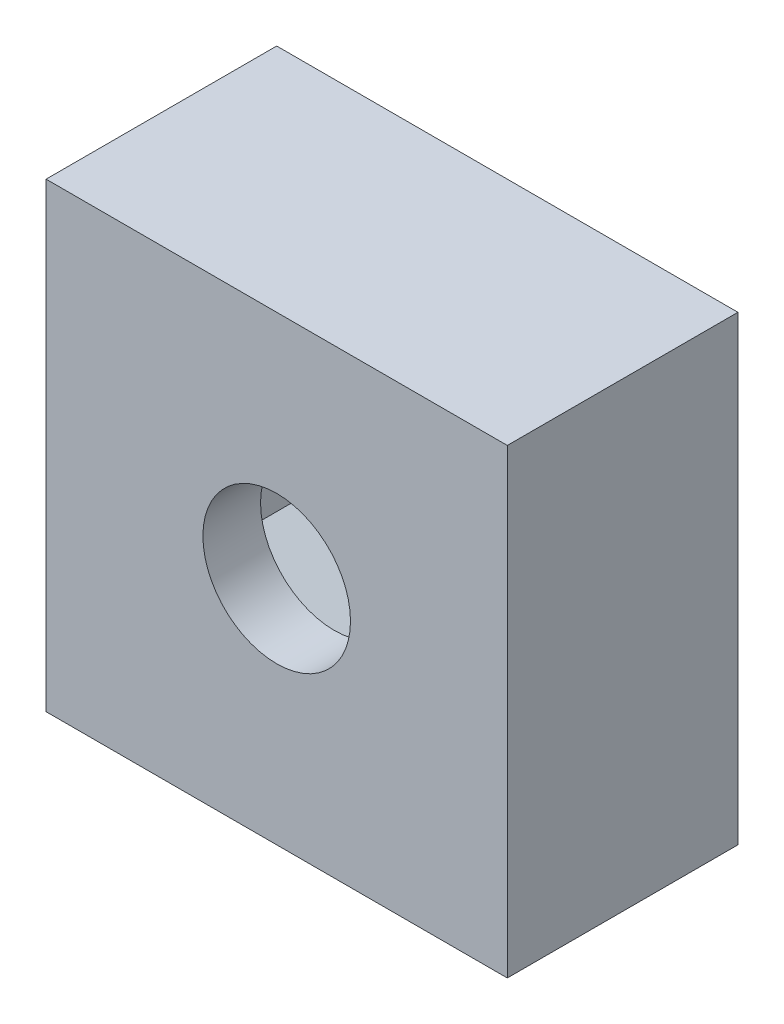
ISO-10303-21;
HEADER;
FILE_DESCRIPTION(('STEP AP214'),'2;1');
FILE_NAME('part.step','',(''),(''),'','','');
FILE_SCHEMA(('AUTOMOTIVE_DESIGN { 1 0 10303 214 1 1 1 1 }'));
ENDSEC;
DATA;
#1=APPLICATION_CONTEXT('core data for automotive mechanical design processes');
#2=APPLICATION_PROTOCOL_DEFINITION('international standard','automotive_design',2000,#1);
#3=PRODUCT_CONTEXT('',#1,'mechanical');
#4=PRODUCT('Part','Part','',(#3));
#5=PRODUCT_RELATED_PRODUCT_CATEGORY('part','',(#4));
#6=PRODUCT_DEFINITION_FORMATION('','',#4);
#7=PRODUCT_DEFINITION_CONTEXT('part definition',#1,'design');
#8=PRODUCT_DEFINITION('design','',#6,#7);
#9=PRODUCT_DEFINITION_SHAPE('','',#8);
#10=(LENGTH_UNIT() NAMED_UNIT(*) SI_UNIT(.MILLI.,.METRE.));
#11=(NAMED_UNIT(*) PLANE_ANGLE_UNIT() SI_UNIT($,.RADIAN.));
#12=(NAMED_UNIT(*) SI_UNIT($,.STERADIAN.) SOLID_ANGLE_UNIT());
#13=UNCERTAINTY_MEASURE_WITH_UNIT(LENGTH_MEASURE(1.E-05),#10,'distance_accuracy_value','');
#14=(GEOMETRIC_REPRESENTATION_CONTEXT(3) GLOBAL_UNCERTAINTY_ASSIGNED_CONTEXT((#13)) GLOBAL_UNIT_ASSIGNED_CONTEXT((#10,
#11,#12)) REPRESENTATION_CONTEXT('',''));
#15=CARTESIAN_POINT('',(0.,0.,0.));
#16=DIRECTION('',(0.,0.,1.));
#17=DIRECTION('',(1.,0.,0.));
#18=AXIS2_PLACEMENT_3D('',#15,#16,#17);
#19=CARTESIAN_POINT('',(2.975,0.,3.75));
#20=DIRECTION('',(-1.,0.,0.));
#21=DIRECTION('',(0.,-1.,0.));
#22=AXIS2_PLACEMENT_3D('',#19,#20,#21);
#23=PLANE('',#22);
#24=DIRECTION('',(0.,1.,0.));
#25=VECTOR('',#24,1.);
#26=CARTESIAN_POINT('',(2.975,0.,1.25));
#27=LINE('',#26,#25);
#28=CARTESIAN_POINT('',(2.975,-1.71761705083914,1.25));
#29=VERTEX_POINT('',#28);
#30=CARTESIAN_POINT('',(2.975,1.71761705083914,1.25));
#31=VERTEX_POINT('',#30);
#32=EDGE_CURVE('E211',#29,#31,#27,.T.);
#33=ORIENTED_EDGE('',*,*,#32,.F.);
#34=DIRECTION('',(0.,0.,-1.));
#35=VECTOR('',#34,1.);
#36=CARTESIAN_POINT('',(2.975,-1.71761705083914,3.75));
#37=LINE('',#36,#35);
#38=CARTESIAN_POINT('',(2.975,-1.71761705083914,3.75));
#39=VERTEX_POINT('',#38);
#40=EDGE_CURVE('E136',#39,#29,#37,.T.);
#41=ORIENTED_EDGE('',*,*,#40,.F.);
#42=DIRECTION('',(0.,1.,0.));
#43=VECTOR('',#42,1.);
#44=CARTESIAN_POINT('',(2.975,0.,3.75));
#45=LINE('',#44,#43);
#46=CARTESIAN_POINT('',(2.975,1.71761705083914,3.75));
#47=VERTEX_POINT('',#46);
#48=EDGE_CURVE('E121',#39,#47,#45,.T.);
#49=ORIENTED_EDGE('',*,*,#48,.T.);
#50=DIRECTION('',(0.,0.,-1.));
#51=VECTOR('',#50,1.);
#52=CARTESIAN_POINT('',(2.975,1.71761705083914,3.75));
#53=LINE('',#52,#51);
#54=EDGE_CURVE('E133',#47,#31,#53,.T.);
#55=ORIENTED_EDGE('',*,*,#54,.T.);
#56=EDGE_LOOP('',(#33,#41,#49,#55));
#57=FACE_BOUND('',#56,.T.);
#58=ADVANCED_FACE('F33',(#57),#23,.T.);
#59=CARTESIAN_POINT('',(1.4875,2.5764255762587,3.75));
#60=DIRECTION('',(-0.5,-0.866025403784439,0.));
#61=DIRECTION('',(0.866025403784439,-0.5,0.));
#62=AXIS2_PLACEMENT_3D('',#59,#60,#61);
#63=PLANE('',#62);
#64=DIRECTION('',(-0.866025403784439,0.5,0.));
#65=VECTOR('',#64,1.);
#66=CARTESIAN_POINT('',(1.4875,2.5764255762587,1.25));
#67=LINE('',#66,#65);
#68=CARTESIAN_POINT('',(0.,3.43523410167827,1.25));
#69=VERTEX_POINT('',#68);
#70=EDGE_CURVE('E140',#31,#69,#67,.T.);
#71=ORIENTED_EDGE('',*,*,#70,.F.);
#72=ORIENTED_EDGE('',*,*,#54,.F.);
#73=DIRECTION('',(-0.866025403784439,0.5,0.));
#74=VECTOR('',#73,1.);
#75=CARTESIAN_POINT('',(1.4875,2.5764255762587,3.75));
#76=LINE('',#75,#74);
#77=CARTESIAN_POINT('',(0.,3.43523410167827,3.75));
#78=VERTEX_POINT('',#77);
#79=EDGE_CURVE('E117',#47,#78,#76,.T.);
#80=ORIENTED_EDGE('',*,*,#79,.T.);
#81=DIRECTION('',(0.,0.,-1.));
#82=VECTOR('',#81,1.);
#83=CARTESIAN_POINT('',(0.,3.43523410167827,3.75));
#84=LINE('',#83,#82);
#85=EDGE_CURVE('E142',#78,#69,#84,.T.);
#86=ORIENTED_EDGE('',*,*,#85,.T.);
#87=EDGE_LOOP('',(#71,#72,#80,#86));
#88=FACE_BOUND('',#87,.T.);
#89=ADVANCED_FACE('F139',(#88),#63,.T.);
#90=CARTESIAN_POINT('',(-1.4875,2.5764255762587,3.75));
#91=DIRECTION('',(0.5,-0.866025403784439,0.));
#92=DIRECTION('',(0.866025403784439,0.5,0.));
#93=AXIS2_PLACEMENT_3D('',#90,#91,#92);
#94=PLANE('',#93);
#95=DIRECTION('',(-0.866025403784439,-0.5,0.));
#96=VECTOR('',#95,1.);
#97=CARTESIAN_POINT('',(-1.4875,2.5764255762587,1.25));
#98=LINE('',#97,#96);
#99=CARTESIAN_POINT('',(-2.975,1.71761705083914,1.25));
#100=VERTEX_POINT('',#99);
#101=EDGE_CURVE('E222',#69,#100,#98,.T.);
#102=ORIENTED_EDGE('',*,*,#101,.F.);
#103=ORIENTED_EDGE('',*,*,#85,.F.);
#104=DIRECTION('',(-0.866025403784439,-0.5,0.));
#105=VECTOR('',#104,1.);
#106=CARTESIAN_POINT('',(-1.4875,2.5764255762587,3.75));
#107=LINE('',#106,#105);
#108=CARTESIAN_POINT('',(-2.975,1.71761705083914,3.75));
#109=VERTEX_POINT('',#108);
#110=EDGE_CURVE('E123',#78,#109,#107,.T.);
#111=ORIENTED_EDGE('',*,*,#110,.T.);
#112=DIRECTION('',(0.,0.,-1.));
#113=VECTOR('',#112,1.);
#114=CARTESIAN_POINT('',(-2.975,1.71761705083914,3.75));
#115=LINE('',#114,#113);
#116=EDGE_CURVE('E146',#109,#100,#115,.T.);
#117=ORIENTED_EDGE('',*,*,#116,.T.);
#118=EDGE_LOOP('',(#102,#103,#111,#117));
#119=FACE_BOUND('',#118,.T.);
#120=ADVANCED_FACE('F192',(#119),#94,.T.);
#121=CARTESIAN_POINT('',(-2.975,0.,3.75));
#122=DIRECTION('',(1.,0.,0.));
#123=DIRECTION('',(0.,0.,-1.));
#124=AXIS2_PLACEMENT_3D('',#121,#122,#123);
#125=PLANE('',#124);
#126=DIRECTION('',(0.,-1.,0.));
#127=VECTOR('',#126,1.);
#128=CARTESIAN_POINT('',(-2.975,0.,1.25));
#129=LINE('',#128,#127);
#130=CARTESIAN_POINT('',(-2.975,-1.71761705083914,1.25));
#131=VERTEX_POINT('',#130);
#132=EDGE_CURVE('E224',#100,#131,#129,.T.);
#133=ORIENTED_EDGE('',*,*,#132,.F.);
#134=ORIENTED_EDGE('',*,*,#116,.F.);
#135=DIRECTION('',(0.,-1.,0.));
#136=VECTOR('',#135,1.);
#137=CARTESIAN_POINT('',(-2.975,0.,3.75));
#138=LINE('',#137,#136);
#139=CARTESIAN_POINT('',(-2.975,-1.71761705083914,3.75));
#140=VERTEX_POINT('',#139);
#141=EDGE_CURVE('E214',#109,#140,#138,.T.);
#142=ORIENTED_EDGE('',*,*,#141,.T.);
#143=DIRECTION('',(0.,0.,-1.));
#144=VECTOR('',#143,1.);
#145=CARTESIAN_POINT('',(-2.975,-1.71761705083914,3.75));
#146=LINE('',#145,#144);
#147=EDGE_CURVE('E233',#140,#131,#146,.T.);
#148=ORIENTED_EDGE('',*,*,#147,.T.);
#149=EDGE_LOOP('',(#133,#134,#142,#148));
#150=FACE_BOUND('',#149,.T.);
#151=ADVANCED_FACE('F241',(#150),#125,.T.);
#152=CARTESIAN_POINT('',(-1.4875,-2.57642557625871,3.75));
#153=DIRECTION('',(0.5,0.866025403784439,0.));
#154=DIRECTION('',(-0.866025403784439,0.5,0.));
#155=AXIS2_PLACEMENT_3D('',#152,#153,#154);
#156=PLANE('',#155);
#157=DIRECTION('',(0.866025403784439,-0.5,0.));
#158=VECTOR('',#157,1.);
#159=CARTESIAN_POINT('',(-1.4875,-2.57642557625871,1.25));
#160=LINE('',#159,#158);
#161=CARTESIAN_POINT('',(0.,-3.43523410167827,1.25));
#162=VERTEX_POINT('',#161);
#163=EDGE_CURVE('E226',#131,#162,#160,.T.);
#164=ORIENTED_EDGE('',*,*,#163,.F.);
#165=ORIENTED_EDGE('',*,*,#147,.F.);
#166=DIRECTION('',(0.866025403784439,-0.5,0.));
#167=VECTOR('',#166,1.);
#168=CARTESIAN_POINT('',(-1.4875,-2.57642557625871,3.75));
#169=LINE('',#168,#167);
#170=CARTESIAN_POINT('',(0.,-3.43523410167827,3.75));
#171=VERTEX_POINT('',#170);
#172=EDGE_CURVE('E216',#140,#171,#169,.T.);
#173=ORIENTED_EDGE('',*,*,#172,.T.);
#174=DIRECTION('',(0.,0.,-1.));
#175=VECTOR('',#174,1.);
#176=CARTESIAN_POINT('',(0.,-3.43523410167827,3.75));
#177=LINE('',#176,#175);
#178=EDGE_CURVE('E230',#171,#162,#177,.T.);
#179=ORIENTED_EDGE('',*,*,#178,.T.);
#180=EDGE_LOOP('',(#164,#165,#173,#179));
#181=FACE_BOUND('',#180,.T.);
#182=ADVANCED_FACE('F252',(#181),#156,.T.);
#183=CARTESIAN_POINT('',(1.4875,-2.57642557625871,3.75));
#184=DIRECTION('',(-0.5,0.866025403784439,0.));
#185=DIRECTION('',(-0.866025403784439,-0.5,0.));
#186=AXIS2_PLACEMENT_3D('',#183,#184,#185);
#187=PLANE('',#186);
#188=DIRECTION('',(0.866025403784439,0.5,0.));
#189=VECTOR('',#188,1.);
#190=CARTESIAN_POINT('',(1.4875,-2.57642557625871,1.25));
#191=LINE('',#190,#189);
#192=EDGE_CURVE('E137',#162,#29,#191,.T.);
#193=ORIENTED_EDGE('',*,*,#192,.F.);
#194=ORIENTED_EDGE('',*,*,#178,.F.);
#195=DIRECTION('',(0.866025403784439,0.5,0.));
#196=VECTOR('',#195,1.);
#197=CARTESIAN_POINT('',(1.4875,-2.57642557625871,3.75));
#198=LINE('',#197,#196);
#199=EDGE_CURVE('E218',#171,#39,#198,.T.);
#200=ORIENTED_EDGE('',*,*,#199,.T.);
#201=ORIENTED_EDGE('',*,*,#40,.T.);
#202=EDGE_LOOP('',(#193,#194,#200,#201));
#203=FACE_BOUND('',#202,.T.);
#204=ADVANCED_FACE('F249',(#203),#187,.T.);
#205=CARTESIAN_POINT('',(0.,0.,3.75));
#206=DIRECTION('',(0.,0.,1.));
#207=DIRECTION('',(1.,0.,0.));
#208=AXIS2_PLACEMENT_3D('',#205,#206,#207);
#209=PLANE('',#208);
#210=CARTESIAN_POINT('',(0.,0.,3.75));
#211=DIRECTION('',(0.,0.,1.));
#212=DIRECTION('',(1.,0.,0.));
#213=AXIS2_PLACEMENT_3D('',#210,#211,#212);
#214=CIRCLE('',#213,1.6);
#215=CARTESIAN_POINT('',(1.6,0.,3.75));
#216=VERTEX_POINT('',#215);
#217=EDGE_CURVE('E206',#216,#216,#214,.T.);
#218=ORIENTED_EDGE('',*,*,#217,.T.);
#219=EDGE_LOOP('',(#218));
#220=FACE_BOUND('',#219,.T.);
#221=ORIENTED_EDGE('',*,*,#48,.F.);
#222=ORIENTED_EDGE('',*,*,#199,.F.);
#223=ORIENTED_EDGE('',*,*,#172,.F.);
#224=ORIENTED_EDGE('',*,*,#141,.F.);
#225=ORIENTED_EDGE('',*,*,#110,.F.);
#226=ORIENTED_EDGE('',*,*,#79,.F.);
#227=EDGE_LOOP('',(#221,#222,#223,#224,#225,#226));
#228=FACE_BOUND('',#227,.T.);
#229=ADVANCED_FACE('F119',(#220,#228),#209,.F.);
#230=CARTESIAN_POINT('',(0.,0.,1.25));
#231=DIRECTION('',(0.,0.,1.));
#232=DIRECTION('',(1.,0.,0.));
#233=AXIS2_PLACEMENT_3D('',#230,#231,#232);
#234=PLANE('',#233);
#235=CARTESIAN_POINT('',(0.,0.,1.25));
#236=DIRECTION('',(0.,0.,1.));
#237=DIRECTION('',(1.,0.,0.));
#238=AXIS2_PLACEMENT_3D('',#235,#236,#237);
#239=CIRCLE('',#238,1.6);
#240=CARTESIAN_POINT('',(1.6,0.,1.25));
#241=VERTEX_POINT('',#240);
#242=EDGE_CURVE('E37',#241,#241,#239,.T.);
#243=ORIENTED_EDGE('',*,*,#242,.F.);
#244=EDGE_LOOP('',(#243));
#245=FACE_BOUND('',#244,.T.);
#246=ORIENTED_EDGE('',*,*,#32,.T.);
#247=ORIENTED_EDGE('',*,*,#70,.T.);
#248=ORIENTED_EDGE('',*,*,#101,.T.);
#249=ORIENTED_EDGE('',*,*,#132,.T.);
#250=ORIENTED_EDGE('',*,*,#163,.T.);
#251=ORIENTED_EDGE('',*,*,#192,.T.);
#252=EDGE_LOOP('',(#246,#247,#248,#249,#250,#251));
#253=FACE_BOUND('',#252,.T.);
#254=ADVANCED_FACE('F245',(#245,#253),#234,.T.);
#255=CARTESIAN_POINT('',(0.,0.,0.));
#256=DIRECTION('',(0.,0.,1.));
#257=DIRECTION('',(1.,0.,0.));
#258=AXIS2_PLACEMENT_3D('',#255,#256,#257);
#259=CYLINDRICAL_SURFACE('',#258,1.6);
#260=ORIENTED_EDGE('',*,*,#242,.T.);
#261=EDGE_LOOP('',(#260));
#262=FACE_BOUND('',#261,.T.);
#263=CARTESIAN_POINT('',(0.,0.,0.));
#264=DIRECTION('',(0.,0.,1.));
#265=DIRECTION('',(1.,0.,0.));
#266=AXIS2_PLACEMENT_3D('',#263,#264,#265);
#267=CIRCLE('',#266,1.6);
#268=CARTESIAN_POINT('',(1.6,0.,0.));
#269=VERTEX_POINT('',#268);
#270=EDGE_CURVE('E201',#269,#269,#267,.T.);
#271=ORIENTED_EDGE('',*,*,#270,.F.);
#272=EDGE_LOOP('',(#271));
#273=FACE_BOUND('',#272,.T.);
#274=ADVANCED_FACE('F299',(#262,#273),#259,.F.);
#275=CARTESIAN_POINT('',(0.,0.,5.));
#276=DIRECTION('',(0.,0.,1.));
#277=DIRECTION('',(1.,0.,0.));
#278=AXIS2_PLACEMENT_3D('',#275,#276,#277);
#279=CIRCLE('',#278,1.6);
#280=CARTESIAN_POINT('',(1.6,0.,5.));
#281=VERTEX_POINT('',#280);
#282=EDGE_CURVE('E203',#281,#281,#279,.T.);
#283=ORIENTED_EDGE('',*,*,#282,.T.);
#284=EDGE_LOOP('',(#283));
#285=FACE_BOUND('',#284,.T.);
#286=ORIENTED_EDGE('',*,*,#217,.F.);
#287=EDGE_LOOP('',(#286));
#288=FACE_BOUND('',#287,.T.);
#289=ADVANCED_FACE('F308',(#285,#288),#259,.F.);
#290=CARTESIAN_POINT('',(0.,-5.,5.));
#291=DIRECTION('',(0.,1.,0.));
#292=DIRECTION('',(0.,0.,1.));
#293=AXIS2_PLACEMENT_3D('',#290,#291,#292);
#294=PLANE('',#293);
#295=DIRECTION('',(1.,0.,0.));
#296=VECTOR('',#295,1.);
#297=CARTESIAN_POINT('',(0.,-5.,0.));
#298=LINE('',#297,#296);
#299=CARTESIAN_POINT('',(-5.,-5.,0.));
#300=VERTEX_POINT('',#299);
#301=CARTESIAN_POINT('',(5.,-5.,0.));
#302=VERTEX_POINT('',#301);
#303=EDGE_CURVE('E141',#300,#302,#298,.T.);
#304=ORIENTED_EDGE('',*,*,#303,.T.);
#305=DIRECTION('',(0.,0.,-1.));
#306=VECTOR('',#305,1.);
#307=CARTESIAN_POINT('',(5.,-5.,5.));
#308=LINE('',#307,#306);
#309=CARTESIAN_POINT('',(5.,-5.,5.));
#310=VERTEX_POINT('',#309);
#311=EDGE_CURVE('E11',#310,#302,#308,.T.);
#312=ORIENTED_EDGE('',*,*,#311,.F.);
#313=DIRECTION('',(1.,0.,0.));
#314=VECTOR('',#313,1.);
#315=CARTESIAN_POINT('',(0.,-5.,5.));
#316=LINE('',#315,#314);
#317=CARTESIAN_POINT('',(-5.,-5.,5.));
#318=VERTEX_POINT('',#317);
#319=EDGE_CURVE('E150',#318,#310,#316,.T.);
#320=ORIENTED_EDGE('',*,*,#319,.F.);
#321=DIRECTION('',(0.,0.,-1.));
#322=VECTOR('',#321,1.);
#323=CARTESIAN_POINT('',(-5.,-5.,5.));
#324=LINE('',#323,#322);
#325=EDGE_CURVE('E51',#318,#300,#324,.T.);
#326=ORIENTED_EDGE('',*,*,#325,.T.);
#327=EDGE_LOOP('',(#304,#312,#320,#326));
#328=FACE_BOUND('',#327,.T.);
#329=ADVANCED_FACE('F35',(#328),#294,.F.);
#330=CARTESIAN_POINT('',(5.,0.,5.));
#331=DIRECTION('',(-1.,0.,0.));
#332=DIRECTION('',(0.,0.,1.));
#333=AXIS2_PLACEMENT_3D('',#330,#331,#332);
#334=PLANE('',#333);
#335=DIRECTION('',(0.,1.,0.));
#336=VECTOR('',#335,1.);
#337=CARTESIAN_POINT('',(5.,0.,0.));
#338=LINE('',#337,#336);
#339=CARTESIAN_POINT('',(5.,5.,0.));
#340=VERTEX_POINT('',#339);
#341=EDGE_CURVE('E144',#302,#340,#338,.T.);
#342=ORIENTED_EDGE('',*,*,#341,.T.);
#343=DIRECTION('',(0.,0.,-1.));
#344=VECTOR('',#343,1.);
#345=CARTESIAN_POINT('',(5.,5.,5.));
#346=LINE('',#345,#344);
#347=CARTESIAN_POINT('',(5.,5.,5.));
#348=VERTEX_POINT('',#347);
#349=EDGE_CURVE('E43',#348,#340,#346,.T.);
#350=ORIENTED_EDGE('',*,*,#349,.F.);
#351=DIRECTION('',(0.,1.,0.));
#352=VECTOR('',#351,1.);
#353=CARTESIAN_POINT('',(5.,0.,5.));
#354=LINE('',#353,#352);
#355=EDGE_CURVE('E77',#310,#348,#354,.T.);
#356=ORIENTED_EDGE('',*,*,#355,.F.);
#357=ORIENTED_EDGE('',*,*,#311,.T.);
#358=EDGE_LOOP('',(#342,#350,#356,#357));
#359=FACE_BOUND('',#358,.T.);
#360=ADVANCED_FACE('F171',(#359),#334,.F.);
#361=CARTESIAN_POINT('',(0.,5.,5.));
#362=DIRECTION('',(0.,1.,0.));
#363=DIRECTION('',(0.,0.,1.));
#364=AXIS2_PLACEMENT_3D('',#361,#362,#363);
#365=PLANE('',#364);
#366=DIRECTION('',(1.,0.,0.));
#367=VECTOR('',#366,1.);
#368=CARTESIAN_POINT('',(0.,5.,0.));
#369=LINE('',#368,#367);
#370=CARTESIAN_POINT('',(-5.,5.,0.));
#371=VERTEX_POINT('',#370);
#372=EDGE_CURVE('E161',#371,#340,#369,.T.);
#373=ORIENTED_EDGE('',*,*,#372,.F.);
#374=DIRECTION('',(0.,0.,-1.));
#375=VECTOR('',#374,1.);
#376=CARTESIAN_POINT('',(-5.,5.,5.));
#377=LINE('',#376,#375);
#378=CARTESIAN_POINT('',(-5.,5.,5.));
#379=VERTEX_POINT('',#378);
#380=EDGE_CURVE('E66',#379,#371,#377,.T.);
#381=ORIENTED_EDGE('',*,*,#380,.F.);
#382=DIRECTION('',(1.,0.,0.));
#383=VECTOR('',#382,1.);
#384=CARTESIAN_POINT('',(0.,5.,5.));
#385=LINE('',#384,#383);
#386=EDGE_CURVE('E154',#379,#348,#385,.T.);
#387=ORIENTED_EDGE('',*,*,#386,.T.);
#388=ORIENTED_EDGE('',*,*,#349,.T.);
#389=EDGE_LOOP('',(#373,#381,#387,#388));
#390=FACE_BOUND('',#389,.T.);
#391=ADVANCED_FACE('F169',(#390),#365,.T.);
#392=CARTESIAN_POINT('',(-5.,0.,5.));
#393=DIRECTION('',(-1.,0.,0.));
#394=DIRECTION('',(0.,0.,1.));
#395=AXIS2_PLACEMENT_3D('',#392,#393,#394);
#396=PLANE('',#395);
#397=DIRECTION('',(0.,1.,0.));
#398=VECTOR('',#397,1.);
#399=CARTESIAN_POINT('',(-5.,0.,0.));
#400=LINE('',#399,#398);
#401=EDGE_CURVE('E152',#300,#371,#400,.T.);
#402=ORIENTED_EDGE('',*,*,#401,.F.);
#403=ORIENTED_EDGE('',*,*,#325,.F.);
#404=DIRECTION('',(0.,1.,0.));
#405=VECTOR('',#404,1.);
#406=CARTESIAN_POINT('',(-5.,0.,5.));
#407=LINE('',#406,#405);
#408=EDGE_CURVE('E157',#318,#379,#407,.T.);
#409=ORIENTED_EDGE('',*,*,#408,.T.);
#410=ORIENTED_EDGE('',*,*,#380,.T.);
#411=EDGE_LOOP('',(#402,#403,#409,#410));
#412=FACE_BOUND('',#411,.T.);
#413=ADVANCED_FACE('F175',(#412),#396,.T.);
#414=CARTESIAN_POINT('',(0.,0.,5.));
#415=DIRECTION('',(0.,0.,1.));
#416=DIRECTION('',(1.,0.,0.));
#417=AXIS2_PLACEMENT_3D('',#414,#415,#416);
#418=PLANE('',#417);
#419=ORIENTED_EDGE('',*,*,#282,.F.);
#420=EDGE_LOOP('',(#419));
#421=FACE_BOUND('',#420,.T.);
#422=ORIENTED_EDGE('',*,*,#319,.T.);
#423=ORIENTED_EDGE('',*,*,#355,.T.);
#424=ORIENTED_EDGE('',*,*,#386,.F.);
#425=ORIENTED_EDGE('',*,*,#408,.F.);
#426=EDGE_LOOP('',(#422,#423,#424,#425));
#427=FACE_BOUND('',#426,.T.);
#428=ADVANCED_FACE('F177',(#421,#427),#418,.T.);
#429=CARTESIAN_POINT('',(0.,0.,0.));
#430=DIRECTION('',(0.,0.,1.));
#431=DIRECTION('',(1.,0.,0.));
#432=AXIS2_PLACEMENT_3D('',#429,#430,#431);
#433=PLANE('',#432);
#434=ORIENTED_EDGE('',*,*,#270,.T.);
#435=EDGE_LOOP('',(#434));
#436=FACE_BOUND('',#435,.T.);
#437=ORIENTED_EDGE('',*,*,#303,.F.);
#438=ORIENTED_EDGE('',*,*,#401,.T.);
#439=ORIENTED_EDGE('',*,*,#372,.T.);
#440=ORIENTED_EDGE('',*,*,#341,.F.);
#441=EDGE_LOOP('',(#437,#438,#439,#440));
#442=FACE_BOUND('',#441,.T.);
#443=ADVANCED_FACE('F174',(#436,#442),#433,.F.);
#444=CLOSED_SHELL('',(#58,#89,#120,#151,#182,#204,#229,#254,#274,#289,#329,#360,#391,#413,#428,#443));
#445=MANIFOLD_SOLID_BREP('B2',#444);
#446=ADVANCED_BREP_SHAPE_REPRESENTATION('',(#18,#445),#14);
#447=SHAPE_DEFINITION_REPRESENTATION(#9,#446);
ENDSEC;
END-ISO-10303-21;
